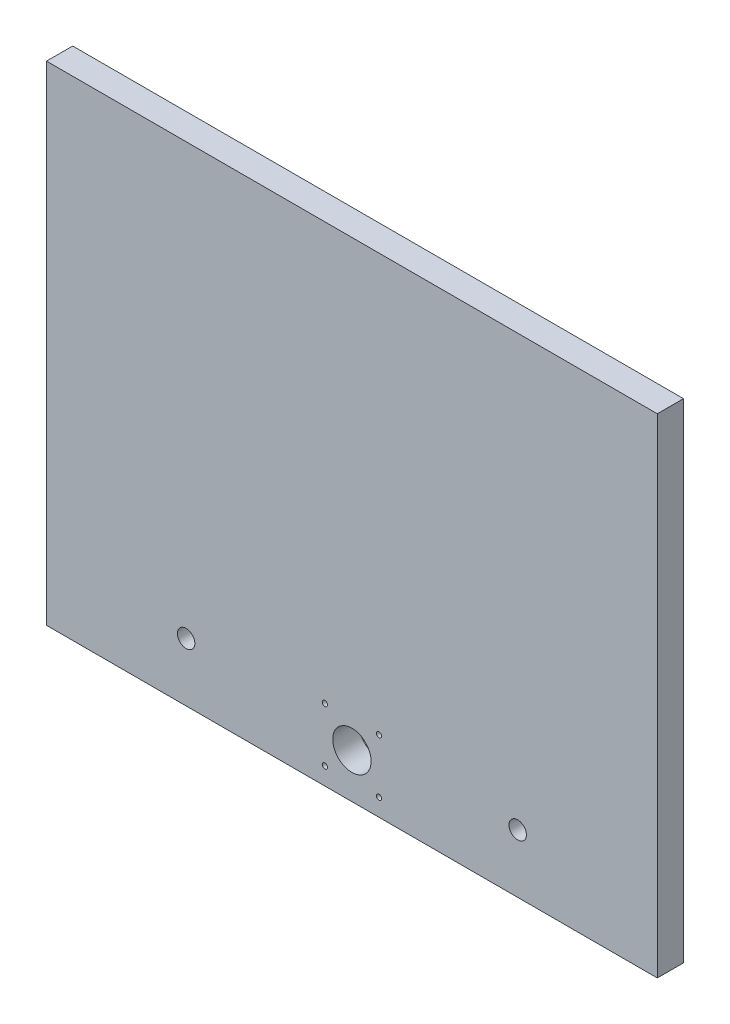
ISO-10303-21;
HEADER;
FILE_DESCRIPTION(('STEP AP214'),'2;1');
FILE_NAME('part.step','',(''),(''),'','','');
FILE_SCHEMA(('AUTOMOTIVE_DESIGN { 1 0 10303 214 1 1 1 1 }'));
ENDSEC;
DATA;
#1=APPLICATION_CONTEXT('core data for automotive mechanical design processes');
#2=APPLICATION_PROTOCOL_DEFINITION('international standard','automotive_design',2000,#1);
#3=PRODUCT_CONTEXT('',#1,'mechanical');
#4=PRODUCT('Part','Part','',(#3));
#5=PRODUCT_RELATED_PRODUCT_CATEGORY('part','',(#4));
#6=PRODUCT_DEFINITION_FORMATION('','',#4);
#7=PRODUCT_DEFINITION_CONTEXT('part definition',#1,'design');
#8=PRODUCT_DEFINITION('design','',#6,#7);
#9=PRODUCT_DEFINITION_SHAPE('','',#8);
#10=(LENGTH_UNIT() NAMED_UNIT(*) SI_UNIT(.MILLI.,.METRE.));
#11=(NAMED_UNIT(*) PLANE_ANGLE_UNIT() SI_UNIT($,.RADIAN.));
#12=(NAMED_UNIT(*) SI_UNIT($,.STERADIAN.) SOLID_ANGLE_UNIT());
#13=UNCERTAINTY_MEASURE_WITH_UNIT(LENGTH_MEASURE(1.E-05),#10,'distance_accuracy_value','');
#14=(GEOMETRIC_REPRESENTATION_CONTEXT(3) GLOBAL_UNCERTAINTY_ASSIGNED_CONTEXT((#13)) GLOBAL_UNIT_ASSIGNED_CONTEXT((#10,
#11,#12)) REPRESENTATION_CONTEXT('',''));
#15=CARTESIAN_POINT('',(0.,0.,0.));
#16=DIRECTION('',(0.,0.,1.));
#17=DIRECTION('',(1.,0.,0.));
#18=AXIS2_PLACEMENT_3D('',#15,#16,#17);
#19=CARTESIAN_POINT('',(0.,0.,15.));
#20=DIRECTION('',(0.,0.,-1.));
#21=DIRECTION('',(-1.,0.,0.));
#22=AXIS2_PLACEMENT_3D('',#19,#20,#21);
#23=PLANE('',#22);
#24=DIRECTION('',(0.,-1.,0.));
#25=VECTOR('',#24,1.);
#26=CARTESIAN_POINT('',(194.918861249326,71.6974539167333,15.));
#27=LINE('',#26,#25);
#28=CARTESIAN_POINT('',(194.918861249326,351.697453916733,15.));
#29=VERTEX_POINT('',#28);
#30=CARTESIAN_POINT('',(194.918861249326,71.6974539167333,15.));
#31=VERTEX_POINT('',#30);
#32=EDGE_CURVE('E84',#29,#31,#27,.T.);
#33=ORIENTED_EDGE('',*,*,#32,.T.);
#34=DIRECTION('',(1.,0.,0.));
#35=VECTOR('',#34,1.);
#36=CARTESIAN_POINT('',(194.918861249326,71.6974539167333,15.));
#37=LINE('',#36,#35);
#38=CARTESIAN_POINT('',(544.918861249326,71.6974539167333,15.));
#39=VERTEX_POINT('',#38);
#40=EDGE_CURVE('E79',#31,#39,#37,.T.);
#41=ORIENTED_EDGE('',*,*,#40,.T.);
#42=DIRECTION('',(0.,1.,0.));
#43=VECTOR('',#42,1.);
#44=CARTESIAN_POINT('',(544.918861249326,71.6974539167333,15.));
#45=LINE('',#44,#43);
#46=CARTESIAN_POINT('',(544.918861249326,351.697453916733,15.));
#47=VERTEX_POINT('',#46);
#48=EDGE_CURVE('E82',#39,#47,#45,.T.);
#49=ORIENTED_EDGE('',*,*,#48,.T.);
#50=DIRECTION('',(-1.,0.,0.));
#51=VECTOR('',#50,1.);
#52=CARTESIAN_POINT('',(194.918861249326,351.697453916733,15.));
#53=LINE('',#52,#51);
#54=EDGE_CURVE('E49',#47,#29,#53,.T.);
#55=ORIENTED_EDGE('',*,*,#54,.T.);
#56=EDGE_LOOP('',(#33,#41,#49,#55));
#57=FACE_BOUND('',#56,.T.);
#58=CARTESIAN_POINT('',(354.418861249326,112.697453916733,15.));
#59=DIRECTION('',(0.,0.,1.));
#60=DIRECTION('',(1.,0.,0.));
#61=AXIS2_PLACEMENT_3D('',#58,#59,#60);
#62=CIRCLE('',#61,1.50000000000002);
#63=CARTESIAN_POINT('',(355.918861249326,112.697453916733,15.));
#64=VERTEX_POINT('',#63);
#65=EDGE_CURVE('E99',#64,#64,#62,.T.);
#66=ORIENTED_EDGE('',*,*,#65,.F.);
#67=EDGE_LOOP('',(#66));
#68=FACE_BOUND('',#67,.T.);
#69=CARTESIAN_POINT('',(385.418861249326,112.697453916733,15.));
#70=DIRECTION('',(0.,0.,1.));
#71=DIRECTION('',(1.,0.,0.));
#72=AXIS2_PLACEMENT_3D('',#69,#70,#71);
#73=CIRCLE('',#72,1.50000000000002);
#74=CARTESIAN_POINT('',(386.918861249326,112.697453916733,15.));
#75=VERTEX_POINT('',#74);
#76=EDGE_CURVE('E114',#75,#75,#73,.T.);
#77=ORIENTED_EDGE('',*,*,#76,.F.);
#78=EDGE_LOOP('',(#77));
#79=FACE_BOUND('',#78,.T.);
#80=CARTESIAN_POINT('',(354.418861249326,81.6974539167333,15.));
#81=DIRECTION('',(0.,0.,1.));
#82=DIRECTION('',(1.,0.,0.));
#83=AXIS2_PLACEMENT_3D('',#80,#81,#82);
#84=CIRCLE('',#83,1.50000000000002);
#85=CARTESIAN_POINT('',(355.918861249326,81.6974539167333,15.));
#86=VERTEX_POINT('',#85);
#87=EDGE_CURVE('E120',#86,#86,#84,.T.);
#88=ORIENTED_EDGE('',*,*,#87,.F.);
#89=EDGE_LOOP('',(#88));
#90=FACE_BOUND('',#89,.T.);
#91=CARTESIAN_POINT('',(385.418861249326,81.6974539167333,15.));
#92=DIRECTION('',(0.,0.,1.));
#93=DIRECTION('',(1.,0.,0.));
#94=AXIS2_PLACEMENT_3D('',#91,#92,#93);
#95=CIRCLE('',#94,1.50000000000002);
#96=CARTESIAN_POINT('',(386.918861249326,81.6974539167333,15.));
#97=VERTEX_POINT('',#96);
#98=EDGE_CURVE('E126',#97,#97,#95,.T.);
#99=ORIENTED_EDGE('',*,*,#98,.F.);
#100=EDGE_LOOP('',(#99));
#101=FACE_BOUND('',#100,.T.);
#102=CARTESIAN_POINT('',(274.918861249326,105.197453916735,15.));
#103=DIRECTION('',(0.,0.,1.));
#104=DIRECTION('',(1.,0.,0.));
#105=AXIS2_PLACEMENT_3D('',#102,#103,#104);
#106=CIRCLE('',#105,4.99999999999994);
#107=CARTESIAN_POINT('',(279.918861249326,105.197453916735,15.));
#108=VERTEX_POINT('',#107);
#109=EDGE_CURVE('E132',#108,#108,#106,.T.);
#110=ORIENTED_EDGE('',*,*,#109,.F.);
#111=EDGE_LOOP('',(#110));
#112=FACE_BOUND('',#111,.T.);
#113=CARTESIAN_POINT('',(464.918861249326,105.197453916735,15.));
#114=DIRECTION('',(0.,0.,1.));
#115=DIRECTION('',(1.,0.,0.));
#116=AXIS2_PLACEMENT_3D('',#113,#114,#115);
#117=CIRCLE('',#116,4.99999999999999);
#118=CARTESIAN_POINT('',(469.918861249326,105.197453916735,15.));
#119=VERTEX_POINT('',#118);
#120=EDGE_CURVE('E138',#119,#119,#117,.T.);
#121=ORIENTED_EDGE('',*,*,#120,.F.);
#122=EDGE_LOOP('',(#121));
#123=FACE_BOUND('',#122,.T.);
#124=CARTESIAN_POINT('',(369.918861249326,97.1974539167333,15.));
#125=DIRECTION('',(0.,0.,1.));
#126=DIRECTION('',(1.,0.,0.));
#127=AXIS2_PLACEMENT_3D('',#124,#125,#126);
#128=CIRCLE('',#127,11.);
#129=CARTESIAN_POINT('',(380.918861249326,97.1974539167333,15.));
#130=VERTEX_POINT('',#129);
#131=EDGE_CURVE('E144',#130,#130,#128,.T.);
#132=ORIENTED_EDGE('',*,*,#131,.F.);
#133=EDGE_LOOP('',(#132));
#134=FACE_BOUND('',#133,.T.);
#135=ADVANCED_FACE('F32',(#57,#68,#79,#90,#101,#112,#123,#134),#23,.F.);
#136=CARTESIAN_POINT('',(0.,0.,0.));
#137=DIRECTION('',(0.,0.,-1.));
#138=DIRECTION('',(-1.,0.,0.));
#139=AXIS2_PLACEMENT_3D('',#136,#137,#138);
#140=PLANE('',#139);
#141=CARTESIAN_POINT('',(464.918861249326,105.197453916735,0.));
#142=DIRECTION('',(0.,0.,1.));
#143=DIRECTION('',(1.,0.,0.));
#144=AXIS2_PLACEMENT_3D('',#141,#142,#143);
#145=CIRCLE('',#144,4.99999999999999);
#146=CARTESIAN_POINT('',(469.918861249326,105.197453916735,0.));
#147=VERTEX_POINT('',#146);
#148=EDGE_CURVE('E141',#147,#147,#145,.T.);
#149=ORIENTED_EDGE('',*,*,#148,.T.);
#150=EDGE_LOOP('',(#149));
#151=FACE_BOUND('',#150,.T.);
#152=CARTESIAN_POINT('',(385.418861249326,81.6974539167333,0.));
#153=DIRECTION('',(0.,0.,1.));
#154=DIRECTION('',(1.,0.,0.));
#155=AXIS2_PLACEMENT_3D('',#152,#153,#154);
#156=CIRCLE('',#155,1.50000000000002);
#157=CARTESIAN_POINT('',(386.918861249326,81.6974539167333,0.));
#158=VERTEX_POINT('',#157);
#159=EDGE_CURVE('E129',#158,#158,#156,.T.);
#160=ORIENTED_EDGE('',*,*,#159,.T.);
#161=EDGE_LOOP('',(#160));
#162=FACE_BOUND('',#161,.T.);
#163=CARTESIAN_POINT('',(385.418861249326,112.697453916733,0.));
#164=DIRECTION('',(0.,0.,1.));
#165=DIRECTION('',(1.,0.,0.));
#166=AXIS2_PLACEMENT_3D('',#163,#164,#165);
#167=CIRCLE('',#166,1.50000000000002);
#168=CARTESIAN_POINT('',(386.918861249326,112.697453916733,0.));
#169=VERTEX_POINT('',#168);
#170=EDGE_CURVE('E117',#169,#169,#167,.T.);
#171=ORIENTED_EDGE('',*,*,#170,.T.);
#172=EDGE_LOOP('',(#171));
#173=FACE_BOUND('',#172,.T.);
#174=DIRECTION('',(0.,-1.,0.));
#175=VECTOR('',#174,1.);
#176=CARTESIAN_POINT('',(194.918861249326,71.6974539167333,0.));
#177=LINE('',#176,#175);
#178=CARTESIAN_POINT('',(194.918861249326,351.697453916733,0.));
#179=VERTEX_POINT('',#178);
#180=CARTESIAN_POINT('',(194.918861249326,71.6974539167333,0.));
#181=VERTEX_POINT('',#180);
#182=EDGE_CURVE('E96',#179,#181,#177,.T.);
#183=ORIENTED_EDGE('',*,*,#182,.F.);
#184=DIRECTION('',(-1.,0.,0.));
#185=VECTOR('',#184,1.);
#186=CARTESIAN_POINT('',(194.918861249326,351.697453916733,0.));
#187=LINE('',#186,#185);
#188=CARTESIAN_POINT('',(544.918861249326,351.697453916733,0.));
#189=VERTEX_POINT('',#188);
#190=EDGE_CURVE('E72',#189,#179,#187,.T.);
#191=ORIENTED_EDGE('',*,*,#190,.F.);
#192=DIRECTION('',(0.,1.,0.));
#193=VECTOR('',#192,1.);
#194=CARTESIAN_POINT('',(544.918861249326,71.6974539167333,0.));
#195=LINE('',#194,#193);
#196=CARTESIAN_POINT('',(544.918861249326,71.6974539167333,0.));
#197=VERTEX_POINT('',#196);
#198=EDGE_CURVE('E66',#197,#189,#195,.T.);
#199=ORIENTED_EDGE('',*,*,#198,.F.);
#200=DIRECTION('',(1.,0.,0.));
#201=VECTOR('',#200,1.);
#202=CARTESIAN_POINT('',(194.918861249326,71.6974539167333,0.));
#203=LINE('',#202,#201);
#204=EDGE_CURVE('E88',#181,#197,#203,.T.);
#205=ORIENTED_EDGE('',*,*,#204,.F.);
#206=EDGE_LOOP('',(#183,#191,#199,#205));
#207=FACE_BOUND('',#206,.T.);
#208=CARTESIAN_POINT('',(354.418861249326,112.697453916733,0.));
#209=DIRECTION('',(0.,0.,1.));
#210=DIRECTION('',(1.,0.,0.));
#211=AXIS2_PLACEMENT_3D('',#208,#209,#210);
#212=CIRCLE('',#211,1.50000000000002);
#213=CARTESIAN_POINT('',(355.918861249326,112.697453916733,0.));
#214=VERTEX_POINT('',#213);
#215=EDGE_CURVE('E111',#214,#214,#212,.T.);
#216=ORIENTED_EDGE('',*,*,#215,.T.);
#217=EDGE_LOOP('',(#216));
#218=FACE_BOUND('',#217,.T.);
#219=CARTESIAN_POINT('',(354.418861249326,81.6974539167333,0.));
#220=DIRECTION('',(0.,0.,1.));
#221=DIRECTION('',(1.,0.,0.));
#222=AXIS2_PLACEMENT_3D('',#219,#220,#221);
#223=CIRCLE('',#222,1.50000000000002);
#224=CARTESIAN_POINT('',(355.918861249326,81.6974539167333,0.));
#225=VERTEX_POINT('',#224);
#226=EDGE_CURVE('E123',#225,#225,#223,.T.);
#227=ORIENTED_EDGE('',*,*,#226,.T.);
#228=EDGE_LOOP('',(#227));
#229=FACE_BOUND('',#228,.T.);
#230=CARTESIAN_POINT('',(274.918861249326,105.197453916735,0.));
#231=DIRECTION('',(0.,0.,1.));
#232=DIRECTION('',(1.,0.,0.));
#233=AXIS2_PLACEMENT_3D('',#230,#231,#232);
#234=CIRCLE('',#233,4.99999999999994);
#235=CARTESIAN_POINT('',(279.918861249326,105.197453916735,0.));
#236=VERTEX_POINT('',#235);
#237=EDGE_CURVE('E135',#236,#236,#234,.T.);
#238=ORIENTED_EDGE('',*,*,#237,.T.);
#239=EDGE_LOOP('',(#238));
#240=FACE_BOUND('',#239,.T.);
#241=CARTESIAN_POINT('',(369.918861249326,97.1974539167333,0.));
#242=DIRECTION('',(0.,0.,1.));
#243=DIRECTION('',(1.,0.,0.));
#244=AXIS2_PLACEMENT_3D('',#241,#242,#243);
#245=CIRCLE('',#244,11.);
#246=CARTESIAN_POINT('',(380.918861249326,97.1974539167333,0.));
#247=VERTEX_POINT('',#246);
#248=EDGE_CURVE('E147',#247,#247,#245,.T.);
#249=ORIENTED_EDGE('',*,*,#248,.T.);
#250=EDGE_LOOP('',(#249));
#251=FACE_BOUND('',#250,.T.);
#252=ADVANCED_FACE('F107',(#151,#162,#173,#207,#218,#229,#240,#251),#140,.T.);
#253=CARTESIAN_POINT('',(194.918861249326,71.6974539167333,15.));
#254=DIRECTION('',(1.,0.,0.));
#255=DIRECTION('',(0.,1.,0.));
#256=AXIS2_PLACEMENT_3D('',#253,#254,#255);
#257=PLANE('',#256);
#258=ORIENTED_EDGE('',*,*,#182,.T.);
#259=DIRECTION('',(0.,0.,-1.));
#260=VECTOR('',#259,1.);
#261=CARTESIAN_POINT('',(194.918861249326,71.6974539167333,15.));
#262=LINE('',#261,#260);
#263=EDGE_CURVE('E11',#31,#181,#262,.T.);
#264=ORIENTED_EDGE('',*,*,#263,.F.);
#265=ORIENTED_EDGE('',*,*,#32,.F.);
#266=DIRECTION('',(0.,0.,-1.));
#267=VECTOR('',#266,1.);
#268=CARTESIAN_POINT('',(194.918861249326,351.697453916733,15.));
#269=LINE('',#268,#267);
#270=EDGE_CURVE('E92',#29,#179,#269,.T.);
#271=ORIENTED_EDGE('',*,*,#270,.T.);
#272=EDGE_LOOP('',(#258,#264,#265,#271));
#273=FACE_BOUND('',#272,.T.);
#274=ADVANCED_FACE('F34',(#273),#257,.F.);
#275=CARTESIAN_POINT('',(194.918861249326,71.6974539167333,15.));
#276=DIRECTION('',(0.,1.,0.));
#277=DIRECTION('',(0.,0.,1.));
#278=AXIS2_PLACEMENT_3D('',#275,#276,#277);
#279=PLANE('',#278);
#280=ORIENTED_EDGE('',*,*,#204,.T.);
#281=DIRECTION('',(0.,0.,-1.));
#282=VECTOR('',#281,1.);
#283=CARTESIAN_POINT('',(544.918861249326,71.6974539167333,15.));
#284=LINE('',#283,#282);
#285=EDGE_CURVE('E41',#39,#197,#284,.T.);
#286=ORIENTED_EDGE('',*,*,#285,.F.);
#287=ORIENTED_EDGE('',*,*,#40,.F.);
#288=ORIENTED_EDGE('',*,*,#263,.T.);
#289=EDGE_LOOP('',(#280,#286,#287,#288));
#290=FACE_BOUND('',#289,.T.);
#291=ADVANCED_FACE('F87',(#290),#279,.F.);
#292=CARTESIAN_POINT('',(544.918861249326,71.6974539167333,15.));
#293=DIRECTION('',(-1.,0.,0.));
#294=DIRECTION('',(0.,0.,1.));
#295=AXIS2_PLACEMENT_3D('',#292,#293,#294);
#296=PLANE('',#295);
#297=ORIENTED_EDGE('',*,*,#198,.T.);
#298=DIRECTION('',(0.,0.,-1.));
#299=VECTOR('',#298,1.);
#300=CARTESIAN_POINT('',(544.918861249326,351.697453916733,15.));
#301=LINE('',#300,#299);
#302=EDGE_CURVE('E89',#47,#189,#301,.T.);
#303=ORIENTED_EDGE('',*,*,#302,.F.);
#304=ORIENTED_EDGE('',*,*,#48,.F.);
#305=ORIENTED_EDGE('',*,*,#285,.T.);
#306=EDGE_LOOP('',(#297,#303,#304,#305));
#307=FACE_BOUND('',#306,.T.);
#308=ADVANCED_FACE('F90',(#307),#296,.F.);
#309=CARTESIAN_POINT('',(194.918861249326,351.697453916733,15.));
#310=DIRECTION('',(0.,-1.,0.));
#311=DIRECTION('',(0.,0.,-1.));
#312=AXIS2_PLACEMENT_3D('',#309,#310,#311);
#313=PLANE('',#312);
#314=ORIENTED_EDGE('',*,*,#190,.T.);
#315=ORIENTED_EDGE('',*,*,#270,.F.);
#316=ORIENTED_EDGE('',*,*,#54,.F.);
#317=ORIENTED_EDGE('',*,*,#302,.T.);
#318=EDGE_LOOP('',(#314,#315,#316,#317));
#319=FACE_BOUND('',#318,.T.);
#320=ADVANCED_FACE('F104',(#319),#313,.F.);
#321=CARTESIAN_POINT('',(354.418861249326,112.697453916733,15.));
#322=DIRECTION('',(0.,0.,-1.));
#323=DIRECTION('',(-1.,0.,0.));
#324=AXIS2_PLACEMENT_3D('',#321,#322,#323);
#325=CYLINDRICAL_SURFACE('',#324,1.50000000000002);
#326=ORIENTED_EDGE('',*,*,#65,.T.);
#327=EDGE_LOOP('',(#326));
#328=FACE_BOUND('',#327,.T.);
#329=ORIENTED_EDGE('',*,*,#215,.F.);
#330=EDGE_LOOP('',(#329));
#331=FACE_BOUND('',#330,.T.);
#332=ADVANCED_FACE('F164',(#328,#331),#325,.F.);
#333=CARTESIAN_POINT('',(385.418861249326,112.697453916733,15.));
#334=DIRECTION('',(0.,0.,-1.));
#335=DIRECTION('',(-1.,0.,0.));
#336=AXIS2_PLACEMENT_3D('',#333,#334,#335);
#337=CYLINDRICAL_SURFACE('',#336,1.50000000000002);
#338=ORIENTED_EDGE('',*,*,#76,.T.);
#339=EDGE_LOOP('',(#338));
#340=FACE_BOUND('',#339,.T.);
#341=ORIENTED_EDGE('',*,*,#170,.F.);
#342=EDGE_LOOP('',(#341));
#343=FACE_BOUND('',#342,.T.);
#344=ADVANCED_FACE('F210',(#340,#343),#337,.F.);
#345=CARTESIAN_POINT('',(354.418861249326,81.6974539167333,15.));
#346=DIRECTION('',(0.,0.,-1.));
#347=DIRECTION('',(-1.,0.,0.));
#348=AXIS2_PLACEMENT_3D('',#345,#346,#347);
#349=CYLINDRICAL_SURFACE('',#348,1.50000000000002);
#350=ORIENTED_EDGE('',*,*,#87,.T.);
#351=EDGE_LOOP('',(#350));
#352=FACE_BOUND('',#351,.T.);
#353=ORIENTED_EDGE('',*,*,#226,.F.);
#354=EDGE_LOOP('',(#353));
#355=FACE_BOUND('',#354,.T.);
#356=ADVANCED_FACE('F218',(#352,#355),#349,.F.);
#357=CARTESIAN_POINT('',(385.418861249326,81.6974539167333,15.));
#358=DIRECTION('',(0.,0.,-1.));
#359=DIRECTION('',(-1.,0.,0.));
#360=AXIS2_PLACEMENT_3D('',#357,#358,#359);
#361=CYLINDRICAL_SURFACE('',#360,1.50000000000002);
#362=ORIENTED_EDGE('',*,*,#98,.T.);
#363=EDGE_LOOP('',(#362));
#364=FACE_BOUND('',#363,.T.);
#365=ORIENTED_EDGE('',*,*,#159,.F.);
#366=EDGE_LOOP('',(#365));
#367=FACE_BOUND('',#366,.T.);
#368=ADVANCED_FACE('F226',(#364,#367),#361,.F.);
#369=CARTESIAN_POINT('',(274.918861249326,105.197453916735,15.));
#370=DIRECTION('',(0.,0.,-1.));
#371=DIRECTION('',(-1.,0.,0.));
#372=AXIS2_PLACEMENT_3D('',#369,#370,#371);
#373=CYLINDRICAL_SURFACE('',#372,4.99999999999994);
#374=ORIENTED_EDGE('',*,*,#109,.T.);
#375=EDGE_LOOP('',(#374));
#376=FACE_BOUND('',#375,.T.);
#377=ORIENTED_EDGE('',*,*,#237,.F.);
#378=EDGE_LOOP('',(#377));
#379=FACE_BOUND('',#378,.T.);
#380=ADVANCED_FACE('F235',(#376,#379),#373,.F.);
#381=CARTESIAN_POINT('',(464.918861249326,105.197453916735,15.));
#382=DIRECTION('',(0.,0.,-1.));
#383=DIRECTION('',(-1.,0.,0.));
#384=AXIS2_PLACEMENT_3D('',#381,#382,#383);
#385=CYLINDRICAL_SURFACE('',#384,4.99999999999999);
#386=ORIENTED_EDGE('',*,*,#120,.T.);
#387=EDGE_LOOP('',(#386));
#388=FACE_BOUND('',#387,.T.);
#389=ORIENTED_EDGE('',*,*,#148,.F.);
#390=EDGE_LOOP('',(#389));
#391=FACE_BOUND('',#390,.T.);
#392=ADVANCED_FACE('F244',(#388,#391),#385,.F.);
#393=CARTESIAN_POINT('',(369.918861249326,97.1974539167333,15.));
#394=DIRECTION('',(0.,0.,-1.));
#395=DIRECTION('',(-1.,0.,0.));
#396=AXIS2_PLACEMENT_3D('',#393,#394,#395);
#397=CYLINDRICAL_SURFACE('',#396,11.);
#398=ORIENTED_EDGE('',*,*,#131,.T.);
#399=EDGE_LOOP('',(#398));
#400=FACE_BOUND('',#399,.T.);
#401=ORIENTED_EDGE('',*,*,#248,.F.);
#402=EDGE_LOOP('',(#401));
#403=FACE_BOUND('',#402,.T.);
#404=ADVANCED_FACE('F153',(#400,#403),#397,.F.);
#405=CLOSED_SHELL('',(#135,#252,#274,#291,#308,#320,#332,#344,#356,#368,#380,#392,#404));
#406=MANIFOLD_SOLID_BREP('B2',#405);
#407=ADVANCED_BREP_SHAPE_REPRESENTATION('',(#18,#406),#14);
#408=SHAPE_DEFINITION_REPRESENTATION(#9,#407);
ENDSEC;
END-ISO-10303-21;
